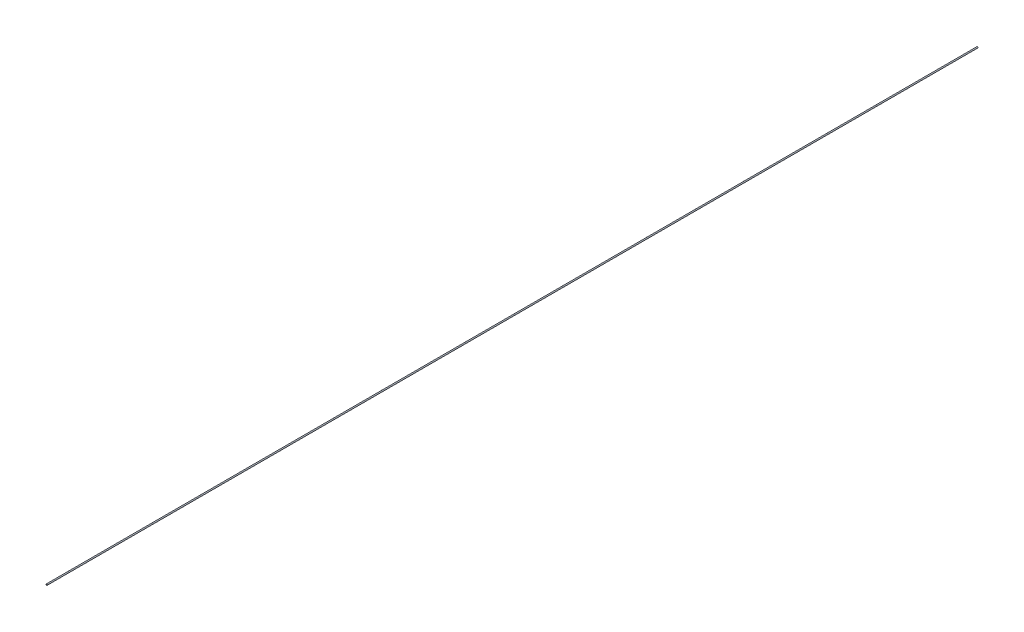
ISO-10303-21;
HEADER;
FILE_DESCRIPTION(('STEP AP214'),'2;1');
FILE_NAME('part.step','',(''),(''),'','','');
FILE_SCHEMA(('AUTOMOTIVE_DESIGN { 1 0 10303 214 1 1 1 1 }'));
ENDSEC;
DATA;
#1=APPLICATION_CONTEXT('core data for automotive mechanical design processes');
#2=APPLICATION_PROTOCOL_DEFINITION('international standard','automotive_design',2000,#1);
#3=PRODUCT_CONTEXT('',#1,'mechanical');
#4=PRODUCT('Part','Part','',(#3));
#5=PRODUCT_RELATED_PRODUCT_CATEGORY('part','',(#4));
#6=PRODUCT_DEFINITION_FORMATION('','',#4);
#7=PRODUCT_DEFINITION_CONTEXT('part definition',#1,'design');
#8=PRODUCT_DEFINITION('design','',#6,#7);
#9=PRODUCT_DEFINITION_SHAPE('','',#8);
#10=(LENGTH_UNIT() NAMED_UNIT(*) SI_UNIT(.MILLI.,.METRE.));
#11=(NAMED_UNIT(*) PLANE_ANGLE_UNIT() SI_UNIT($,.RADIAN.));
#12=(NAMED_UNIT(*) SI_UNIT($,.STERADIAN.) SOLID_ANGLE_UNIT());
#13=UNCERTAINTY_MEASURE_WITH_UNIT(LENGTH_MEASURE(1.E-05),#10,'distance_accuracy_value','');
#14=(GEOMETRIC_REPRESENTATION_CONTEXT(3) GLOBAL_UNCERTAINTY_ASSIGNED_CONTEXT((#13)) GLOBAL_UNIT_ASSIGNED_CONTEXT((#10,
#11,#12)) REPRESENTATION_CONTEXT('',''));
#15=CARTESIAN_POINT('',(0.,0.,0.));
#16=DIRECTION('',(0.,0.,1.));
#17=DIRECTION('',(1.,0.,0.));
#18=AXIS2_PLACEMENT_3D('',#15,#16,#17);
#19=CARTESIAN_POINT('',(0.,0.,55.9));
#20=DIRECTION('',(0.,0.,-1.));
#21=DIRECTION('',(-1.,0.,0.));
#22=AXIS2_PLACEMENT_3D('',#19,#20,#21);
#23=CYLINDRICAL_SURFACE('',#22,0.035);
#24=CARTESIAN_POINT('',(0.,0.,55.9));
#25=DIRECTION('',(0.,0.,1.));
#26=DIRECTION('',(1.,0.,0.));
#27=AXIS2_PLACEMENT_3D('',#24,#25,#26);
#28=CIRCLE('',#27,0.035);
#29=CARTESIAN_POINT('',(0.035,0.,55.9));
#30=VERTEX_POINT('',#29);
#31=EDGE_CURVE('E10',#30,#30,#28,.T.);
#32=ORIENTED_EDGE('',*,*,#31,.F.);
#33=EDGE_LOOP('',(#32));
#34=FACE_BOUND('',#33,.T.);
#35=CARTESIAN_POINT('',(0.,0.,0.));
#36=DIRECTION('',(0.,0.,1.));
#37=DIRECTION('',(1.,0.,0.));
#38=AXIS2_PLACEMENT_3D('',#35,#36,#37);
#39=CIRCLE('',#38,0.035);
#40=CARTESIAN_POINT('',(0.035,0.,0.));
#41=VERTEX_POINT('',#40);
#42=EDGE_CURVE('E40',#41,#41,#39,.T.);
#43=ORIENTED_EDGE('',*,*,#42,.T.);
#44=EDGE_LOOP('',(#43));
#45=FACE_BOUND('',#44,.T.);
#46=ADVANCED_FACE('F37',(#34,#45),#23,.T.);
#47=CARTESIAN_POINT('',(0.,0.,55.9));
#48=DIRECTION('',(0.,0.,1.));
#49=DIRECTION('',(1.,0.,0.));
#50=AXIS2_PLACEMENT_3D('',#47,#48,#49);
#51=PLANE('',#50);
#52=ORIENTED_EDGE('',*,*,#31,.T.);
#53=EDGE_LOOP('',(#52));
#54=FACE_BOUND('',#53,.T.);
#55=ADVANCED_FACE('F56',(#54),#51,.T.);
#56=CARTESIAN_POINT('',(0.,0.,0.));
#57=DIRECTION('',(0.,0.,1.));
#58=DIRECTION('',(1.,0.,0.));
#59=AXIS2_PLACEMENT_3D('',#56,#57,#58);
#60=PLANE('',#59);
#61=ORIENTED_EDGE('',*,*,#42,.F.);
#62=EDGE_LOOP('',(#61));
#63=FACE_BOUND('',#62,.T.);
#64=ADVANCED_FACE('F54',(#63),#60,.F.);
#65=CLOSED_SHELL('',(#46,#55,#64));
#66=MANIFOLD_SOLID_BREP('B2',#65);
#67=ADVANCED_BREP_SHAPE_REPRESENTATION('',(#18,#66),#14);
#68=SHAPE_DEFINITION_REPRESENTATION(#9,#67);
ENDSEC;
END-ISO-10303-21;
